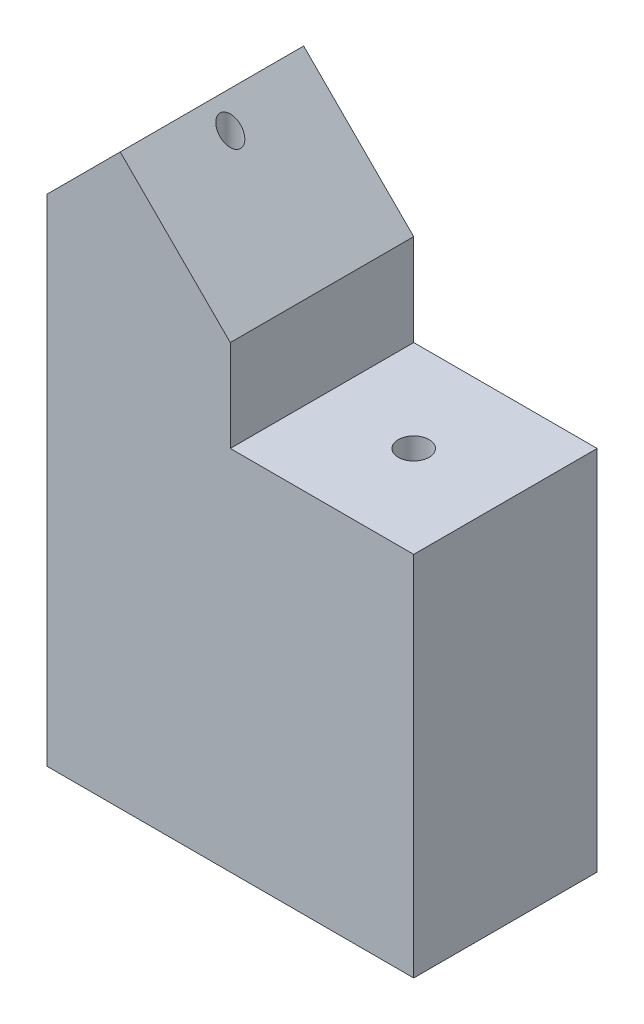
ISO-10303-21;
HEADER;
FILE_DESCRIPTION(('STEP AP214'),'2;1');
FILE_NAME('part.step','',(''),(''),'','','');
FILE_SCHEMA(('AUTOMOTIVE_DESIGN { 1 0 10303 214 1 1 1 1 }'));
ENDSEC;
DATA;
#1=APPLICATION_CONTEXT('core data for automotive mechanical design processes');
#2=APPLICATION_PROTOCOL_DEFINITION('international standard','automotive_design',2000,#1);
#3=PRODUCT_CONTEXT('',#1,'mechanical');
#4=PRODUCT('Part','Part','',(#3));
#5=PRODUCT_RELATED_PRODUCT_CATEGORY('part','',(#4));
#6=PRODUCT_DEFINITION_FORMATION('','',#4);
#7=PRODUCT_DEFINITION_CONTEXT('part definition',#1,'design');
#8=PRODUCT_DEFINITION('design','',#6,#7);
#9=PRODUCT_DEFINITION_SHAPE('','',#8);
#10=(LENGTH_UNIT() NAMED_UNIT(*) SI_UNIT(.MILLI.,.METRE.));
#11=(NAMED_UNIT(*) PLANE_ANGLE_UNIT() SI_UNIT($,.RADIAN.));
#12=(NAMED_UNIT(*) SI_UNIT($,.STERADIAN.) SOLID_ANGLE_UNIT());
#13=UNCERTAINTY_MEASURE_WITH_UNIT(LENGTH_MEASURE(1.E-05),#10,'distance_accuracy_value','');
#14=(GEOMETRIC_REPRESENTATION_CONTEXT(3) GLOBAL_UNCERTAINTY_ASSIGNED_CONTEXT((#13)) GLOBAL_UNIT_ASSIGNED_CONTEXT((#10,
#11,#12)) REPRESENTATION_CONTEXT('',''));
#15=CARTESIAN_POINT('',(0.,0.,0.));
#16=DIRECTION('',(0.,0.,1.));
#17=DIRECTION('',(1.,0.,0.));
#18=AXIS2_PLACEMENT_3D('',#15,#16,#17);
#19=CARTESIAN_POINT('',(-5.,20.,-2.5));
#20=DIRECTION('',(1.,0.,0.));
#21=DIRECTION('',(0.,0.,-1.));
#22=AXIS2_PLACEMENT_3D('',#19,#20,#21);
#23=PLANE('',#22);
#24=DIRECTION('',(0.,-1.,0.));
#25=VECTOR('',#24,1.);
#26=CARTESIAN_POINT('',(-5.,20.,2.5));
#27=LINE('',#26,#25);
#28=CARTESIAN_POINT('',(-5.,13.5,2.5));
#29=VERTEX_POINT('',#28);
#30=CARTESIAN_POINT('',(-5.,0.,2.5));
#31=VERTEX_POINT('',#30);
#32=EDGE_CURVE('E155',#29,#31,#27,.T.);
#33=ORIENTED_EDGE('',*,*,#32,.F.);
#34=DIRECTION('',(0.,0.,-1.));
#35=VECTOR('',#34,1.);
#36=CARTESIAN_POINT('',(-5.,13.5,-2.5));
#37=LINE('',#36,#35);
#38=CARTESIAN_POINT('',(-5.,13.5,-2.5));
#39=VERTEX_POINT('',#38);
#40=EDGE_CURVE('E44',#29,#39,#37,.T.);
#41=ORIENTED_EDGE('',*,*,#40,.T.);
#42=DIRECTION('',(0.,-1.,0.));
#43=VECTOR('',#42,1.);
#44=CARTESIAN_POINT('',(-5.,20.,-2.5));
#45=LINE('',#44,#43);
#46=CARTESIAN_POINT('',(-5.,0.,-2.5));
#47=VERTEX_POINT('',#46);
#48=EDGE_CURVE('E149',#39,#47,#45,.T.);
#49=ORIENTED_EDGE('',*,*,#48,.T.);
#50=DIRECTION('',(0.,0.,1.));
#51=VECTOR('',#50,1.);
#52=CARTESIAN_POINT('',(-5.,0.,-2.5));
#53=LINE('',#52,#51);
#54=EDGE_CURVE('E133',#47,#31,#53,.T.);
#55=ORIENTED_EDGE('',*,*,#54,.T.);
#56=EDGE_LOOP('',(#33,#41,#49,#55));
#57=FACE_BOUND('',#56,.T.);
#58=ADVANCED_FACE('F35',(#57),#23,.F.);
#59=CARTESIAN_POINT('',(5.,20.,2.5));
#60=DIRECTION('',(0.,0.,-1.));
#61=DIRECTION('',(-1.,0.,0.));
#62=AXIS2_PLACEMENT_3D('',#59,#60,#61);
#63=PLANE('',#62);
#64=DIRECTION('',(0.707106781186546,-0.707106781186549,0.));
#65=VECTOR('',#64,1.);
#66=CARTESIAN_POINT('',(-5.,17.5,2.5));
#67=LINE('',#66,#65);
#68=CARTESIAN_POINT('',(-2.99999999999999,15.5,2.5));
#69=VERTEX_POINT('',#68);
#70=CARTESIAN_POINT('',(0.,12.5,2.5));
#71=VERTEX_POINT('',#70);
#72=EDGE_CURVE('E93',#69,#71,#67,.T.);
#73=ORIENTED_EDGE('',*,*,#72,.F.);
#74=DIRECTION('',(0.707106781186551,0.707106781186544,0.));
#75=VECTOR('',#74,1.);
#76=CARTESIAN_POINT('',(-2.99999999999999,15.5,2.5));
#77=LINE('',#76,#75);
#78=EDGE_CURVE('E58',#69,#29,#77,.F.);
#79=ORIENTED_EDGE('',*,*,#78,.T.);
#80=ORIENTED_EDGE('',*,*,#32,.T.);
#81=DIRECTION('',(1.,0.,0.));
#82=VECTOR('',#81,1.);
#83=CARTESIAN_POINT('',(5.,0.,2.5));
#84=LINE('',#83,#82);
#85=CARTESIAN_POINT('',(5.,0.,2.5));
#86=VERTEX_POINT('',#85);
#87=EDGE_CURVE('E140',#31,#86,#84,.T.);
#88=ORIENTED_EDGE('',*,*,#87,.T.);
#89=DIRECTION('',(0.,-1.,0.));
#90=VECTOR('',#89,1.);
#91=CARTESIAN_POINT('',(5.,20.,2.5));
#92=LINE('',#91,#90);
#93=CARTESIAN_POINT('',(5.,10.,2.5));
#94=VERTEX_POINT('',#93);
#95=EDGE_CURVE('E153',#94,#86,#92,.T.);
#96=ORIENTED_EDGE('',*,*,#95,.F.);
#97=DIRECTION('',(1.,0.,0.));
#98=VECTOR('',#97,1.);
#99=CARTESIAN_POINT('',(0.,10.,2.5));
#100=LINE('',#99,#98);
#101=CARTESIAN_POINT('',(0.,10.,2.5));
#102=VERTEX_POINT('',#101);
#103=EDGE_CURVE('E116',#102,#94,#100,.T.);
#104=ORIENTED_EDGE('',*,*,#103,.F.);
#105=DIRECTION('',(0.,-1.,0.));
#106=VECTOR('',#105,1.);
#107=CARTESIAN_POINT('',(0.,12.5,2.5));
#108=LINE('',#107,#106);
#109=EDGE_CURVE('E102',#71,#102,#108,.T.);
#110=ORIENTED_EDGE('',*,*,#109,.F.);
#111=EDGE_LOOP('',(#73,#79,#80,#88,#96,#104,#110));
#112=FACE_BOUND('',#111,.T.);
#113=ADVANCED_FACE('F114',(#112),#63,.F.);
#114=CARTESIAN_POINT('',(5.,20.,-2.5));
#115=DIRECTION('',(-1.,0.,0.));
#116=DIRECTION('',(0.,0.,1.));
#117=AXIS2_PLACEMENT_3D('',#114,#115,#116);
#118=PLANE('',#117);
#119=DIRECTION('',(0.,-1.,0.));
#120=VECTOR('',#119,1.);
#121=CARTESIAN_POINT('',(5.,20.,-2.5));
#122=LINE('',#121,#120);
#123=CARTESIAN_POINT('',(5.,10.,-2.5));
#124=VERTEX_POINT('',#123);
#125=CARTESIAN_POINT('',(5.,0.,-2.5));
#126=VERTEX_POINT('',#125);
#127=EDGE_CURVE('E151',#124,#126,#122,.T.);
#128=ORIENTED_EDGE('',*,*,#127,.F.);
#129=DIRECTION('',(0.,0.,1.));
#130=VECTOR('',#129,1.);
#131=CARTESIAN_POINT('',(5.,10.,-2.5));
#132=LINE('',#131,#130);
#133=EDGE_CURVE('E125',#124,#94,#132,.T.);
#134=ORIENTED_EDGE('',*,*,#133,.T.);
#135=ORIENTED_EDGE('',*,*,#95,.T.);
#136=DIRECTION('',(0.,0.,-1.));
#137=VECTOR('',#136,1.);
#138=CARTESIAN_POINT('',(5.,0.,-2.5));
#139=LINE('',#138,#137);
#140=EDGE_CURVE('E143',#86,#126,#139,.T.);
#141=ORIENTED_EDGE('',*,*,#140,.T.);
#142=EDGE_LOOP('',(#128,#134,#135,#141));
#143=FACE_BOUND('',#142,.T.);
#144=ADVANCED_FACE('F183',(#143),#118,.F.);
#145=CARTESIAN_POINT('',(5.,20.,-2.5));
#146=DIRECTION('',(0.,0.,1.));
#147=DIRECTION('',(1.,0.,0.));
#148=AXIS2_PLACEMENT_3D('',#145,#146,#147);
#149=PLANE('',#148);
#150=ORIENTED_EDGE('',*,*,#48,.F.);
#151=DIRECTION('',(-0.707106781186551,-0.707106781186544,0.));
#152=VECTOR('',#151,1.);
#153=CARTESIAN_POINT('',(-2.99999999999999,15.5,-2.5));
#154=LINE('',#153,#152);
#155=CARTESIAN_POINT('',(-2.99999999999999,15.5,-2.5));
#156=VERTEX_POINT('',#155);
#157=EDGE_CURVE('E11',#39,#156,#154,.F.);
#158=ORIENTED_EDGE('',*,*,#157,.T.);
#159=DIRECTION('',(0.707106781186546,-0.707106781186549,0.));
#160=VECTOR('',#159,1.);
#161=CARTESIAN_POINT('',(-5.,17.5,-2.5));
#162=LINE('',#161,#160);
#163=CARTESIAN_POINT('',(0.,12.5,-2.5));
#164=VERTEX_POINT('',#163);
#165=EDGE_CURVE('E118',#156,#164,#162,.T.);
#166=ORIENTED_EDGE('',*,*,#165,.T.);
#167=DIRECTION('',(0.,-1.,0.));
#168=VECTOR('',#167,1.);
#169=CARTESIAN_POINT('',(0.,12.5,-2.5));
#170=LINE('',#169,#168);
#171=CARTESIAN_POINT('',(0.,10.,-2.5));
#172=VERTEX_POINT('',#171);
#173=EDGE_CURVE('E110',#164,#172,#170,.T.);
#174=ORIENTED_EDGE('',*,*,#173,.T.);
#175=DIRECTION('',(1.,0.,0.));
#176=VECTOR('',#175,1.);
#177=CARTESIAN_POINT('',(0.,10.,-2.5));
#178=LINE('',#177,#176);
#179=EDGE_CURVE('E112',#172,#124,#178,.T.);
#180=ORIENTED_EDGE('',*,*,#179,.T.);
#181=ORIENTED_EDGE('',*,*,#127,.T.);
#182=DIRECTION('',(-1.,0.,0.));
#183=VECTOR('',#182,1.);
#184=CARTESIAN_POINT('',(5.,0.,-2.5));
#185=LINE('',#184,#183);
#186=EDGE_CURVE('E146',#126,#47,#185,.T.);
#187=ORIENTED_EDGE('',*,*,#186,.T.);
#188=EDGE_LOOP('',(#150,#158,#166,#174,#180,#181,#187));
#189=FACE_BOUND('',#188,.T.);
#190=ADVANCED_FACE('F188',(#189),#149,.F.);
#191=CARTESIAN_POINT('',(0.,0.,0.));
#192=DIRECTION('',(0.,-1.,0.));
#193=DIRECTION('',(0.,0.,-1.));
#194=AXIS2_PLACEMENT_3D('',#191,#192,#193);
#195=PLANE('',#194);
#196=CARTESIAN_POINT('',(2.5,0.,0.));
#197=DIRECTION('',(0.,-1.,0.));
#198=DIRECTION('',(0.,0.,-1.));
#199=AXIS2_PLACEMENT_3D('',#196,#197,#198);
#200=CIRCLE('',#199,0.42);
#201=CARTESIAN_POINT('',(2.5,0.,-0.42));
#202=VERTEX_POINT('',#201);
#203=EDGE_CURVE('E130',#202,#202,#200,.T.);
#204=ORIENTED_EDGE('',*,*,#203,.F.);
#205=EDGE_LOOP('',(#204));
#206=FACE_BOUND('',#205,.T.);
#207=CARTESIAN_POINT('',(-2.5,0.,0.));
#208=DIRECTION('',(0.,-1.,0.));
#209=DIRECTION('',(0.,0.,-1.));
#210=AXIS2_PLACEMENT_3D('',#207,#208,#209);
#211=CIRCLE('',#210,0.28);
#212=CARTESIAN_POINT('',(-2.5,0.,-0.28));
#213=VERTEX_POINT('',#212);
#214=EDGE_CURVE('E134',#213,#213,#211,.T.);
#215=ORIENTED_EDGE('',*,*,#214,.F.);
#216=EDGE_LOOP('',(#215));
#217=FACE_BOUND('',#216,.T.);
#218=ORIENTED_EDGE('',*,*,#54,.F.);
#219=ORIENTED_EDGE('',*,*,#186,.F.);
#220=ORIENTED_EDGE('',*,*,#140,.F.);
#221=ORIENTED_EDGE('',*,*,#87,.F.);
#222=EDGE_LOOP('',(#218,#219,#220,#221));
#223=FACE_BOUND('',#222,.T.);
#224=ADVANCED_FACE('F192',(#206,#217,#223),#195,.T.);
#225=CARTESIAN_POINT('',(-2.5,20.,0.));
#226=DIRECTION('',(0.,-1.,0.));
#227=DIRECTION('',(0.,0.,-1.));
#228=AXIS2_PLACEMENT_3D('',#225,#226,#227);
#229=CYLINDRICAL_SURFACE('',#228,0.28);
#230=CARTESIAN_POINT('',(-2.5,15.,0.));
#231=DIRECTION('',(-0.707106781186549,-0.707106781186546,0.));
#232=DIRECTION('',(0.707106781186546,-0.707106781186549,0.));
#233=AXIS2_PLACEMENT_3D('',#230,#231,#232);
#234=ELLIPSE('',#233,0.395979797464467,0.28);
#235=CARTESIAN_POINT('',(-2.22,14.72,0.));
#236=VERTEX_POINT('',#235);
#237=EDGE_CURVE('E137',#236,#236,#234,.F.);
#238=ORIENTED_EDGE('',*,*,#237,.T.);
#239=EDGE_LOOP('',(#238));
#240=FACE_BOUND('',#239,.T.);
#241=ORIENTED_EDGE('',*,*,#214,.T.);
#242=EDGE_LOOP('',(#241));
#243=FACE_BOUND('',#242,.T.);
#244=ADVANCED_FACE('F164',(#240,#243),#229,.F.);
#245=CARTESIAN_POINT('',(2.5,20.,0.));
#246=DIRECTION('',(0.,-1.,0.));
#247=DIRECTION('',(0.,0.,-1.));
#248=AXIS2_PLACEMENT_3D('',#245,#246,#247);
#249=CYLINDRICAL_SURFACE('',#248,0.42);
#250=CARTESIAN_POINT('',(2.5,10.,0.));
#251=DIRECTION('',(0.,-1.,0.));
#252=DIRECTION('',(0.,0.,-1.));
#253=AXIS2_PLACEMENT_3D('',#250,#251,#252);
#254=CIRCLE('',#253,0.42);
#255=CARTESIAN_POINT('',(2.5,10.,-0.42));
#256=VERTEX_POINT('',#255);
#257=EDGE_CURVE('E128',#256,#256,#254,.F.);
#258=ORIENTED_EDGE('',*,*,#257,.T.);
#259=EDGE_LOOP('',(#258));
#260=FACE_BOUND('',#259,.T.);
#261=ORIENTED_EDGE('',*,*,#203,.T.);
#262=EDGE_LOOP('',(#261));
#263=FACE_BOUND('',#262,.T.);
#264=ADVANCED_FACE('F168',(#260,#263),#249,.F.);
#265=CARTESIAN_POINT('',(-5.,17.5,-2.5));
#266=DIRECTION('',(-0.707106781186549,-0.707106781186546,0.));
#267=DIRECTION('',(0.707106781186546,-0.707106781186549,0.));
#268=AXIS2_PLACEMENT_3D('',#265,#266,#267);
#269=PLANE('',#268);
#270=ORIENTED_EDGE('',*,*,#165,.F.);
#271=DIRECTION('',(0.,0.,1.));
#272=VECTOR('',#271,1.);
#273=CARTESIAN_POINT('',(-2.99999999999999,15.5,-2.5));
#274=LINE('',#273,#272);
#275=EDGE_CURVE('E100',#156,#69,#274,.T.);
#276=ORIENTED_EDGE('',*,*,#275,.T.);
#277=ORIENTED_EDGE('',*,*,#72,.T.);
#278=DIRECTION('',(0.,0.,1.));
#279=VECTOR('',#278,1.);
#280=CARTESIAN_POINT('',(0.,12.5,-2.5));
#281=LINE('',#280,#279);
#282=EDGE_CURVE('E98',#164,#71,#281,.T.);
#283=ORIENTED_EDGE('',*,*,#282,.F.);
#284=EDGE_LOOP('',(#270,#276,#277,#283));
#285=FACE_BOUND('',#284,.T.);
#286=ORIENTED_EDGE('',*,*,#237,.F.);
#287=EDGE_LOOP('',(#286));
#288=FACE_BOUND('',#287,.T.);
#289=ADVANCED_FACE('F96',(#285,#288),#269,.F.);
#290=CARTESIAN_POINT('',(0.,10.,-2.5));
#291=DIRECTION('',(0.,-1.,0.));
#292=DIRECTION('',(0.,0.,-1.));
#293=AXIS2_PLACEMENT_3D('',#290,#291,#292);
#294=PLANE('',#293);
#295=ORIENTED_EDGE('',*,*,#133,.F.);
#296=ORIENTED_EDGE('',*,*,#179,.F.);
#297=DIRECTION('',(0.,0.,1.));
#298=VECTOR('',#297,1.);
#299=CARTESIAN_POINT('',(0.,10.,-2.5));
#300=LINE('',#299,#298);
#301=EDGE_CURVE('E111',#172,#102,#300,.T.);
#302=ORIENTED_EDGE('',*,*,#301,.T.);
#303=ORIENTED_EDGE('',*,*,#103,.T.);
#304=EDGE_LOOP('',(#295,#296,#302,#303));
#305=FACE_BOUND('',#304,.T.);
#306=ORIENTED_EDGE('',*,*,#257,.F.);
#307=EDGE_LOOP('',(#306));
#308=FACE_BOUND('',#307,.T.);
#309=ADVANCED_FACE('F167',(#305,#308),#294,.F.);
#310=CARTESIAN_POINT('',(0.,12.5,-2.5));
#311=DIRECTION('',(-1.,0.,0.));
#312=DIRECTION('',(0.,-1.,0.));
#313=AXIS2_PLACEMENT_3D('',#310,#311,#312);
#314=PLANE('',#313);
#315=ORIENTED_EDGE('',*,*,#301,.F.);
#316=ORIENTED_EDGE('',*,*,#173,.F.);
#317=ORIENTED_EDGE('',*,*,#282,.T.);
#318=ORIENTED_EDGE('',*,*,#109,.T.);
#319=EDGE_LOOP('',(#315,#316,#317,#318));
#320=FACE_BOUND('',#319,.T.);
#321=ADVANCED_FACE('F107',(#320),#314,.F.);
#322=CARTESIAN_POINT('',(-2.99999999999999,15.5,-2.5));
#323=DIRECTION('',(0.707106781186544,-0.707106781186551,0.));
#324=DIRECTION('',(0.,0.,1.));
#325=AXIS2_PLACEMENT_3D('',#322,#323,#324);
#326=PLANE('',#325);
#327=ORIENTED_EDGE('',*,*,#157,.F.);
#328=ORIENTED_EDGE('',*,*,#40,.F.);
#329=ORIENTED_EDGE('',*,*,#78,.F.);
#330=ORIENTED_EDGE('',*,*,#275,.F.);
#331=EDGE_LOOP('',(#327,#328,#329,#330));
#332=FACE_BOUND('',#331,.T.);
#333=ADVANCED_FACE('F38',(#332),#326,.F.);
#334=CLOSED_SHELL('',(#58,#113,#144,#190,#224,#244,#264,#289,#309,#321,#333));
#335=MANIFOLD_SOLID_BREP('B2',#334);
#336=ADVANCED_BREP_SHAPE_REPRESENTATION('',(#18,#335),#14);
#337=SHAPE_DEFINITION_REPRESENTATION(#9,#336);
ENDSEC;
END-ISO-10303-21;
